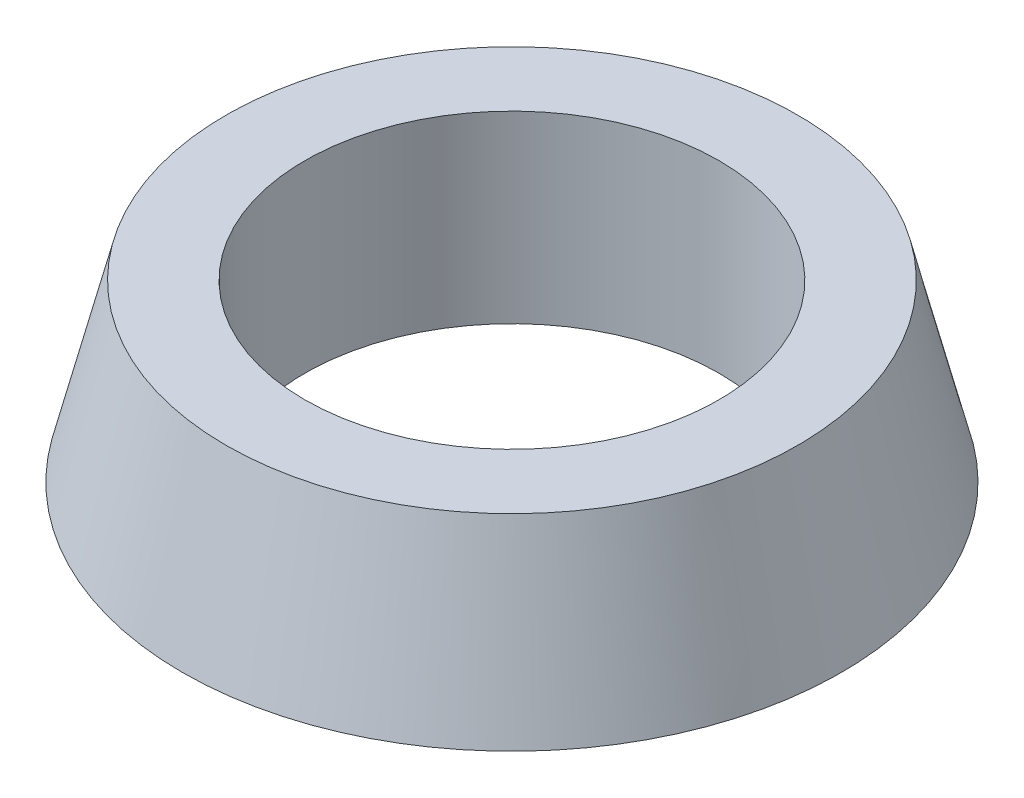
ISO-10303-21;
HEADER;
FILE_DESCRIPTION(('STEP AP214'),'2;1');
FILE_NAME('part.step','',(''),(''),'','','');
FILE_SCHEMA(('AUTOMOTIVE_DESIGN { 1 0 10303 214 1 1 1 1 }'));
ENDSEC;
DATA;
#1=APPLICATION_CONTEXT('core data for automotive mechanical design processes');
#2=APPLICATION_PROTOCOL_DEFINITION('international standard','automotive_design',2000,#1);
#3=PRODUCT_CONTEXT('',#1,'mechanical');
#4=PRODUCT('Part','Part','',(#3));
#5=PRODUCT_RELATED_PRODUCT_CATEGORY('part','',(#4));
#6=PRODUCT_DEFINITION_FORMATION('','',#4);
#7=PRODUCT_DEFINITION_CONTEXT('part definition',#1,'design');
#8=PRODUCT_DEFINITION('design','',#6,#7);
#9=PRODUCT_DEFINITION_SHAPE('','',#8);
#10=(LENGTH_UNIT() NAMED_UNIT(*) SI_UNIT(.MILLI.,.METRE.));
#11=(NAMED_UNIT(*) PLANE_ANGLE_UNIT() SI_UNIT($,.RADIAN.));
#12=(NAMED_UNIT(*) SI_UNIT($,.STERADIAN.) SOLID_ANGLE_UNIT());
#13=UNCERTAINTY_MEASURE_WITH_UNIT(LENGTH_MEASURE(1.E-05),#10,'distance_accuracy_value','');
#14=(GEOMETRIC_REPRESENTATION_CONTEXT(3) GLOBAL_UNCERTAINTY_ASSIGNED_CONTEXT((#13)) GLOBAL_UNIT_ASSIGNED_CONTEXT((#10,
#11,#12)) REPRESENTATION_CONTEXT('',''));
#15=CARTESIAN_POINT('',(0.,0.,0.));
#16=DIRECTION('',(0.,0.,1.));
#17=DIRECTION('',(1.,0.,0.));
#18=AXIS2_PLACEMENT_3D('',#15,#16,#17);
#19=CARTESIAN_POINT('',(30.3,0.0652829597102846,0.));
#20=DIRECTION('',(0.,1.,0.));
#21=DIRECTION('',(0.,0.,1.));
#22=AXIS2_PLACEMENT_3D('',#19,#20,#21);
#23=PLANE('',#22);
#24=CARTESIAN_POINT('',(0.,0.065282959710285,0.));
#25=DIRECTION('',(0.,1.,0.));
#26=DIRECTION('',(0.,0.,1.));
#27=AXIS2_PLACEMENT_3D('',#24,#25,#26);
#28=CIRCLE('',#27,30.3);
#29=CARTESIAN_POINT('',(0.,0.065282959710285,30.3));
#30=VERTEX_POINT('',#29);
#31=EDGE_CURVE('E52',#30,#30,#28,.T.);
#32=ORIENTED_EDGE('',*,*,#31,.F.);
#33=EDGE_LOOP('',(#32));
#34=FACE_BOUND('',#33,.T.);
#35=CARTESIAN_POINT('',(0.,0.0652829597102842,0.));
#36=DIRECTION('',(0.,1.,0.));
#37=DIRECTION('',(0.,0.,1.));
#38=AXIS2_PLACEMENT_3D('',#35,#36,#37);
#39=CIRCLE('',#38,22.5);
#40=CARTESIAN_POINT('',(0.,0.0652829597102842,22.5));
#41=VERTEX_POINT('',#40);
#42=EDGE_CURVE('E10',#41,#41,#39,.T.);
#43=ORIENTED_EDGE('',*,*,#42,.T.);
#44=EDGE_LOOP('',(#43));
#45=FACE_BOUND('',#44,.T.);
#46=ADVANCED_FACE('F30',(#34,#45),#23,.F.);
#47=CARTESIAN_POINT('',(0.,0.,0.));
#48=DIRECTION('',(0.,1.,0.));
#49=DIRECTION('',(0.,0.,1.));
#50=AXIS2_PLACEMENT_3D('',#47,#48,#49);
#51=CYLINDRICAL_SURFACE('',#50,22.5);
#52=ORIENTED_EDGE('',*,*,#42,.F.);
#53=EDGE_LOOP('',(#52));
#54=FACE_BOUND('',#53,.T.);
#55=CARTESIAN_POINT('',(0.,20.0652829597103,0.));
#56=DIRECTION('',(0.,1.,0.));
#57=DIRECTION('',(0.,0.,1.));
#58=AXIS2_PLACEMENT_3D('',#55,#56,#57);
#59=CIRCLE('',#58,22.5);
#60=CARTESIAN_POINT('',(0.,20.0652829597103,22.5));
#61=VERTEX_POINT('',#60);
#62=EDGE_CURVE('E36',#61,#61,#59,.T.);
#63=ORIENTED_EDGE('',*,*,#62,.T.);
#64=EDGE_LOOP('',(#63));
#65=FACE_BOUND('',#64,.T.);
#66=ADVANCED_FACE('F59',(#54,#65),#51,.F.);
#67=CARTESIAN_POINT('',(22.5,20.0652829597103,0.));
#68=DIRECTION('',(0.,-1.,0.));
#69=DIRECTION('',(0.,0.,-1.));
#70=AXIS2_PLACEMENT_3D('',#67,#68,#69);
#71=PLANE('',#70);
#72=ORIENTED_EDGE('',*,*,#62,.F.);
#73=EDGE_LOOP('',(#72));
#74=FACE_BOUND('',#73,.T.);
#75=CARTESIAN_POINT('',(0.,20.0652829597103,0.));
#76=DIRECTION('',(0.,1.,0.));
#77=DIRECTION('',(0.,0.,1.));
#78=AXIS2_PLACEMENT_3D('',#75,#76,#77);
#79=CIRCLE('',#78,31.0627679459796);
#80=CARTESIAN_POINT('',(0.,20.0652829597103,31.0627679459796));
#81=VERTEX_POINT('',#80);
#82=EDGE_CURVE('E40',#81,#81,#79,.T.);
#83=ORIENTED_EDGE('',*,*,#82,.T.);
#84=EDGE_LOOP('',(#83));
#85=FACE_BOUND('',#84,.T.);
#86=ADVANCED_FACE('F63',(#74,#85),#71,.F.);
#87=CARTESIAN_POINT('',(0.,1.06528295971029,0.));
#88=DIRECTION('',(0.,-1.,0.));
#89=DIRECTION('',(0.,0.,-1.));
#90=AXIS2_PLACEMENT_3D('',#87,#88,#89);
#91=CONICAL_SURFACE('',#90,35.8,0.244346095279204);
#92=ORIENTED_EDGE('',*,*,#82,.F.);
#93=EDGE_LOOP('',(#92));
#94=FACE_BOUND('',#93,.T.);
#95=CARTESIAN_POINT('',(0.,1.06528295971029,0.));
#96=DIRECTION('',(0.,1.,0.));
#97=DIRECTION('',(0.,0.,1.));
#98=AXIS2_PLACEMENT_3D('',#95,#96,#97);
#99=CIRCLE('',#98,35.8);
#100=CARTESIAN_POINT('',(0.,1.06528295971029,35.8));
#101=VERTEX_POINT('',#100);
#102=EDGE_CURVE('E44',#101,#101,#99,.T.);
#103=ORIENTED_EDGE('',*,*,#102,.T.);
#104=EDGE_LOOP('',(#103));
#105=FACE_BOUND('',#104,.T.);
#106=ADVANCED_FACE('F68',(#94,#105),#91,.T.);
#107=CARTESIAN_POINT('',(35.8,1.06528295971029,0.));
#108=DIRECTION('',(0.,1.,0.));
#109=DIRECTION('',(0.,0.,1.));
#110=AXIS2_PLACEMENT_3D('',#107,#108,#109);
#111=PLANE('',#110);
#112=ORIENTED_EDGE('',*,*,#102,.F.);
#113=EDGE_LOOP('',(#112));
#114=FACE_BOUND('',#113,.T.);
#115=CARTESIAN_POINT('',(0.,1.06528295971029,0.));
#116=DIRECTION('',(0.,1.,0.));
#117=DIRECTION('',(0.,0.,1.));
#118=AXIS2_PLACEMENT_3D('',#115,#116,#117);
#119=CIRCLE('',#118,30.3);
#120=CARTESIAN_POINT('',(0.,1.06528295971029,30.3));
#121=VERTEX_POINT('',#120);
#122=EDGE_CURVE('E49',#121,#121,#119,.T.);
#123=ORIENTED_EDGE('',*,*,#122,.T.);
#124=EDGE_LOOP('',(#123));
#125=FACE_BOUND('',#124,.T.);
#126=ADVANCED_FACE('F74',(#114,#125),#111,.F.);
#127=CARTESIAN_POINT('',(0.,0.,0.));
#128=DIRECTION('',(0.,1.,0.));
#129=DIRECTION('',(0.,0.,1.));
#130=AXIS2_PLACEMENT_3D('',#127,#128,#129);
#131=CYLINDRICAL_SURFACE('',#130,30.3);
#132=ORIENTED_EDGE('',*,*,#122,.F.);
#133=EDGE_LOOP('',(#132));
#134=FACE_BOUND('',#133,.T.);
#135=ORIENTED_EDGE('',*,*,#31,.T.);
#136=EDGE_LOOP('',(#135));
#137=FACE_BOUND('',#136,.T.);
#138=ADVANCED_FACE('F56',(#134,#137),#131,.T.);
#139=CLOSED_SHELL('',(#46,#66,#86,#106,#126,#138));
#140=MANIFOLD_SOLID_BREP('B2',#139);
#141=ADVANCED_BREP_SHAPE_REPRESENTATION('',(#18,#140),#14);
#142=SHAPE_DEFINITION_REPRESENTATION(#9,#141);
ENDSEC;
END-ISO-10303-21;
